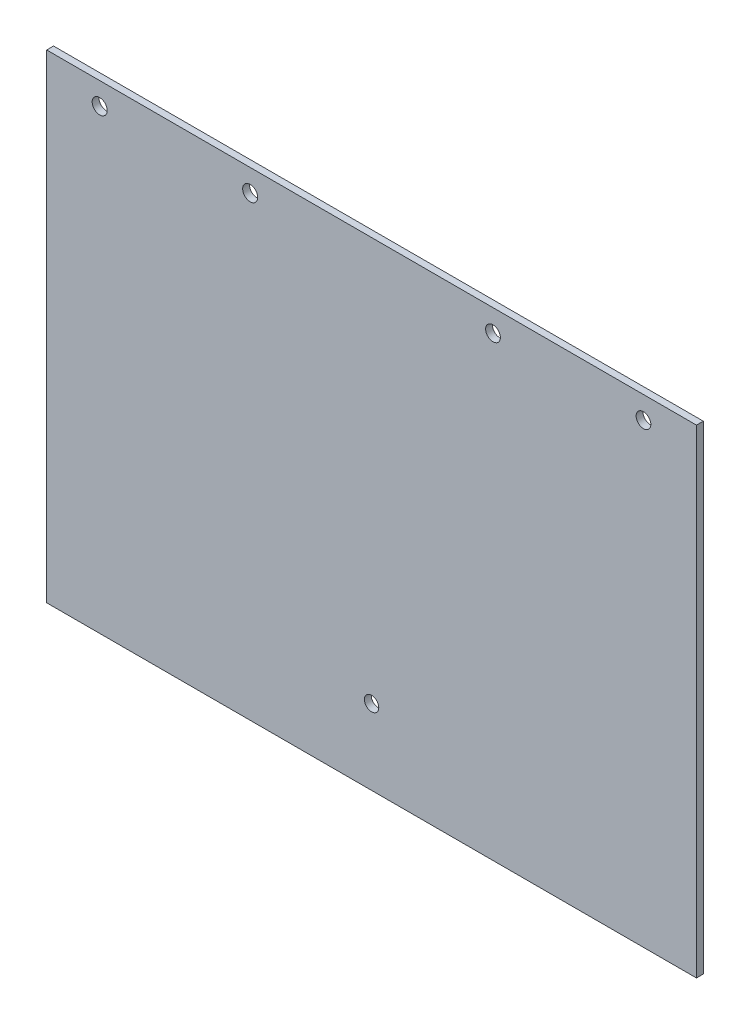
ISO-10303-21;
HEADER;
FILE_DESCRIPTION(('STEP AP214'),'2;1');
FILE_NAME('part.step','',(''),(''),'','','');
FILE_SCHEMA(('AUTOMOTIVE_DESIGN { 1 0 10303 214 1 1 1 1 }'));
ENDSEC;
DATA;
#1=APPLICATION_CONTEXT('core data for automotive mechanical design processes');
#2=APPLICATION_PROTOCOL_DEFINITION('international standard','automotive_design',2000,#1);
#3=PRODUCT_CONTEXT('',#1,'mechanical');
#4=PRODUCT('Part','Part','',(#3));
#5=PRODUCT_RELATED_PRODUCT_CATEGORY('part','',(#4));
#6=PRODUCT_DEFINITION_FORMATION('','',#4);
#7=PRODUCT_DEFINITION_CONTEXT('part definition',#1,'design');
#8=PRODUCT_DEFINITION('design','',#6,#7);
#9=PRODUCT_DEFINITION_SHAPE('','',#8);
#10=(LENGTH_UNIT() NAMED_UNIT(*) SI_UNIT(.MILLI.,.METRE.));
#11=(NAMED_UNIT(*) PLANE_ANGLE_UNIT() SI_UNIT($,.RADIAN.));
#12=(NAMED_UNIT(*) SI_UNIT($,.STERADIAN.) SOLID_ANGLE_UNIT());
#13=UNCERTAINTY_MEASURE_WITH_UNIT(LENGTH_MEASURE(1.E-05),#10,'distance_accuracy_value','');
#14=(GEOMETRIC_REPRESENTATION_CONTEXT(3) GLOBAL_UNCERTAINTY_ASSIGNED_CONTEXT((#13)) GLOBAL_UNIT_ASSIGNED_CONTEXT((#10,
#11,#12)) REPRESENTATION_CONTEXT('',''));
#15=CARTESIAN_POINT('',(0.,0.,0.));
#16=DIRECTION('',(0.,0.,1.));
#17=DIRECTION('',(1.,0.,0.));
#18=AXIS2_PLACEMENT_3D('',#15,#16,#17);
#19=CARTESIAN_POINT('',(-95.,-70.,2.));
#20=DIRECTION('',(0.,1.,0.));
#21=DIRECTION('',(0.,0.,1.));
#22=AXIS2_PLACEMENT_3D('',#19,#20,#21);
#23=PLANE('',#22);
#24=DIRECTION('',(1.,0.,0.));
#25=VECTOR('',#24,1.);
#26=CARTESIAN_POINT('',(-95.,-70.,0.));
#27=LINE('',#26,#25);
#28=CARTESIAN_POINT('',(-95.,-70.,0.));
#29=VERTEX_POINT('',#28);
#30=CARTESIAN_POINT('',(95.,-70.,0.));
#31=VERTEX_POINT('',#30);
#32=EDGE_CURVE('E110',#29,#31,#27,.T.);
#33=ORIENTED_EDGE('',*,*,#32,.T.);
#34=DIRECTION('',(0.,0.,-1.));
#35=VECTOR('',#34,1.);
#36=CARTESIAN_POINT('',(95.,-70.,2.));
#37=LINE('',#36,#35);
#38=CARTESIAN_POINT('',(95.,-70.,2.));
#39=VERTEX_POINT('',#38);
#40=EDGE_CURVE('E11',#39,#31,#37,.T.);
#41=ORIENTED_EDGE('',*,*,#40,.F.);
#42=DIRECTION('',(1.,0.,0.));
#43=VECTOR('',#42,1.);
#44=CARTESIAN_POINT('',(-95.,-70.,2.));
#45=LINE('',#44,#43);
#46=CARTESIAN_POINT('',(-95.,-70.,2.));
#47=VERTEX_POINT('',#46);
#48=EDGE_CURVE('E82',#47,#39,#45,.T.);
#49=ORIENTED_EDGE('',*,*,#48,.F.);
#50=DIRECTION('',(0.,0.,-1.));
#51=VECTOR('',#50,1.);
#52=CARTESIAN_POINT('',(-95.,-70.,2.));
#53=LINE('',#52,#51);
#54=EDGE_CURVE('E106',#47,#29,#53,.T.);
#55=ORIENTED_EDGE('',*,*,#54,.T.);
#56=EDGE_LOOP('',(#33,#41,#49,#55));
#57=FACE_BOUND('',#56,.T.);
#58=ADVANCED_FACE('F40',(#57),#23,.F.);
#59=CARTESIAN_POINT('',(95.,70.,2.));
#60=DIRECTION('',(1.,0.,0.));
#61=DIRECTION('',(0.,1.,0.));
#62=AXIS2_PLACEMENT_3D('',#59,#60,#61);
#63=PLANE('',#62);
#64=DIRECTION('',(0.,-1.,0.));
#65=VECTOR('',#64,1.);
#66=CARTESIAN_POINT('',(95.,70.,0.));
#67=LINE('',#66,#65);
#68=CARTESIAN_POINT('',(95.,70.,0.));
#69=VERTEX_POINT('',#68);
#70=EDGE_CURVE('E91',#69,#31,#67,.T.);
#71=ORIENTED_EDGE('',*,*,#70,.F.);
#72=DIRECTION('',(0.,0.,-1.));
#73=VECTOR('',#72,1.);
#74=CARTESIAN_POINT('',(95.,70.,2.));
#75=LINE('',#74,#73);
#76=CARTESIAN_POINT('',(95.,70.,2.));
#77=VERTEX_POINT('',#76);
#78=EDGE_CURVE('E50',#77,#69,#75,.T.);
#79=ORIENTED_EDGE('',*,*,#78,.F.);
#80=DIRECTION('',(0.,-1.,0.));
#81=VECTOR('',#80,1.);
#82=CARTESIAN_POINT('',(95.,70.,2.));
#83=LINE('',#82,#81);
#84=EDGE_CURVE('E89',#77,#39,#83,.T.);
#85=ORIENTED_EDGE('',*,*,#84,.T.);
#86=ORIENTED_EDGE('',*,*,#40,.T.);
#87=EDGE_LOOP('',(#71,#79,#85,#86));
#88=FACE_BOUND('',#87,.T.);
#89=ADVANCED_FACE('F88',(#88),#63,.T.);
#90=CARTESIAN_POINT('',(-95.,70.,2.));
#91=DIRECTION('',(0.,1.,0.));
#92=DIRECTION('',(0.,0.,1.));
#93=AXIS2_PLACEMENT_3D('',#90,#91,#92);
#94=PLANE('',#93);
#95=DIRECTION('',(1.,0.,0.));
#96=VECTOR('',#95,1.);
#97=CARTESIAN_POINT('',(-95.,70.,0.));
#98=LINE('',#97,#96);
#99=CARTESIAN_POINT('',(-95.,70.,0.));
#100=VERTEX_POINT('',#99);
#101=EDGE_CURVE('E117',#100,#69,#98,.T.);
#102=ORIENTED_EDGE('',*,*,#101,.F.);
#103=DIRECTION('',(0.,0.,-1.));
#104=VECTOR('',#103,1.);
#105=CARTESIAN_POINT('',(-95.,70.,2.));
#106=LINE('',#105,#104);
#107=CARTESIAN_POINT('',(-95.,70.,2.));
#108=VERTEX_POINT('',#107);
#109=EDGE_CURVE('E74',#108,#100,#106,.T.);
#110=ORIENTED_EDGE('',*,*,#109,.F.);
#111=DIRECTION('',(1.,0.,0.));
#112=VECTOR('',#111,1.);
#113=CARTESIAN_POINT('',(-95.,70.,2.));
#114=LINE('',#113,#112);
#115=EDGE_CURVE('E99',#108,#77,#114,.T.);
#116=ORIENTED_EDGE('',*,*,#115,.T.);
#117=ORIENTED_EDGE('',*,*,#78,.T.);
#118=EDGE_LOOP('',(#102,#110,#116,#117));
#119=FACE_BOUND('',#118,.T.);
#120=ADVANCED_FACE('F102',(#119),#94,.T.);
#121=CARTESIAN_POINT('',(-95.,70.,2.));
#122=DIRECTION('',(1.,0.,0.));
#123=DIRECTION('',(0.,1.,0.));
#124=AXIS2_PLACEMENT_3D('',#121,#122,#123);
#125=PLANE('',#124);
#126=DIRECTION('',(0.,-1.,0.));
#127=VECTOR('',#126,1.);
#128=CARTESIAN_POINT('',(-95.,70.,0.));
#129=LINE('',#128,#127);
#130=EDGE_CURVE('E77',#100,#29,#129,.T.);
#131=ORIENTED_EDGE('',*,*,#130,.T.);
#132=ORIENTED_EDGE('',*,*,#54,.F.);
#133=DIRECTION('',(0.,-1.,0.));
#134=VECTOR('',#133,1.);
#135=CARTESIAN_POINT('',(-95.,70.,2.));
#136=LINE('',#135,#134);
#137=EDGE_CURVE('E59',#108,#47,#136,.T.);
#138=ORIENTED_EDGE('',*,*,#137,.F.);
#139=ORIENTED_EDGE('',*,*,#109,.T.);
#140=EDGE_LOOP('',(#131,#132,#138,#139));
#141=FACE_BOUND('',#140,.T.);
#142=ADVANCED_FACE('F159',(#141),#125,.F.);
#143=CARTESIAN_POINT('',(0.,0.,2.));
#144=DIRECTION('',(0.,0.,-1.));
#145=DIRECTION('',(-1.,0.,0.));
#146=AXIS2_PLACEMENT_3D('',#143,#144,#145);
#147=PLANE('',#146);
#148=CARTESIAN_POINT('',(0.,-48.,2.));
#149=DIRECTION('',(0.,0.,1.));
#150=DIRECTION('',(1.,0.,0.));
#151=AXIS2_PLACEMENT_3D('',#148,#149,#150);
#152=CIRCLE('',#151,2.1);
#153=CARTESIAN_POINT('',(2.1,-48.,2.));
#154=VERTEX_POINT('',#153);
#155=EDGE_CURVE('E253',#154,#154,#152,.T.);
#156=ORIENTED_EDGE('',*,*,#155,.F.);
#157=EDGE_LOOP('',(#156));
#158=FACE_BOUND('',#157,.T.);
#159=CARTESIAN_POINT('',(-79.5,63.5,2.));
#160=DIRECTION('',(0.,0.,1.));
#161=DIRECTION('',(1.,0.,0.));
#162=AXIS2_PLACEMENT_3D('',#159,#160,#161);
#163=CIRCLE('',#162,2.2);
#164=CARTESIAN_POINT('',(-77.3,63.5,2.));
#165=VERTEX_POINT('',#164);
#166=EDGE_CURVE('E131',#165,#165,#163,.T.);
#167=ORIENTED_EDGE('',*,*,#166,.F.);
#168=EDGE_LOOP('',(#167));
#169=FACE_BOUND('',#168,.T.);
#170=CARTESIAN_POINT('',(35.5,63.5,2.));
#171=DIRECTION('',(0.,0.,1.));
#172=DIRECTION('',(1.,0.,0.));
#173=AXIS2_PLACEMENT_3D('',#170,#171,#172);
#174=CIRCLE('',#173,2.15);
#175=CARTESIAN_POINT('',(37.65,63.5,2.));
#176=VERTEX_POINT('',#175);
#177=EDGE_CURVE('E257',#176,#176,#174,.T.);
#178=ORIENTED_EDGE('',*,*,#177,.F.);
#179=EDGE_LOOP('',(#178));
#180=FACE_BOUND('',#179,.T.);
#181=CARTESIAN_POINT('',(79.5,63.5,2.));
#182=DIRECTION('',(0.,0.,1.));
#183=DIRECTION('',(1.,0.,0.));
#184=AXIS2_PLACEMENT_3D('',#181,#182,#183);
#185=CIRCLE('',#184,2.15);
#186=CARTESIAN_POINT('',(81.65,63.5,2.));
#187=VERTEX_POINT('',#186);
#188=EDGE_CURVE('E266',#187,#187,#185,.T.);
#189=ORIENTED_EDGE('',*,*,#188,.F.);
#190=EDGE_LOOP('',(#189));
#191=FACE_BOUND('',#190,.T.);
#192=CARTESIAN_POINT('',(-35.5,63.5,2.));
#193=DIRECTION('',(0.,0.,1.));
#194=DIRECTION('',(1.,0.,0.));
#195=AXIS2_PLACEMENT_3D('',#192,#193,#194);
#196=CIRCLE('',#195,2.2);
#197=CARTESIAN_POINT('',(-33.3,63.5,2.));
#198=VERTEX_POINT('',#197);
#199=EDGE_CURVE('E262',#198,#198,#196,.T.);
#200=ORIENTED_EDGE('',*,*,#199,.F.);
#201=EDGE_LOOP('',(#200));
#202=FACE_BOUND('',#201,.T.);
#203=ORIENTED_EDGE('',*,*,#48,.T.);
#204=ORIENTED_EDGE('',*,*,#84,.F.);
#205=ORIENTED_EDGE('',*,*,#115,.F.);
#206=ORIENTED_EDGE('',*,*,#137,.T.);
#207=EDGE_LOOP('',(#203,#204,#205,#206));
#208=FACE_BOUND('',#207,.T.);
#209=ADVANCED_FACE('F98',(#158,#169,#180,#191,#202,#208),#147,.F.);
#210=CARTESIAN_POINT('',(0.,0.,0.));
#211=DIRECTION('',(0.,0.,-1.));
#212=DIRECTION('',(-1.,0.,0.));
#213=AXIS2_PLACEMENT_3D('',#210,#211,#212);
#214=PLANE('',#213);
#215=CARTESIAN_POINT('',(0.,-48.,0.));
#216=DIRECTION('',(0.,0.,-1.));
#217=DIRECTION('',(-1.,0.,0.));
#218=AXIS2_PLACEMENT_3D('',#215,#216,#217);
#219=CIRCLE('',#218,2.1);
#220=CARTESIAN_POINT('',(-2.1,-48.,0.));
#221=VERTEX_POINT('',#220);
#222=EDGE_CURVE('E43',#221,#221,#219,.T.);
#223=ORIENTED_EDGE('',*,*,#222,.F.);
#224=EDGE_LOOP('',(#223));
#225=FACE_BOUND('',#224,.T.);
#226=CARTESIAN_POINT('',(-79.5,63.5,0.));
#227=DIRECTION('',(0.,0.,-1.));
#228=DIRECTION('',(-1.,0.,0.));
#229=AXIS2_PLACEMENT_3D('',#226,#227,#228);
#230=CIRCLE('',#229,2.2);
#231=CARTESIAN_POINT('',(-81.7,63.5,0.));
#232=VERTEX_POINT('',#231);
#233=EDGE_CURVE('E114',#232,#232,#230,.T.);
#234=ORIENTED_EDGE('',*,*,#233,.F.);
#235=EDGE_LOOP('',(#234));
#236=FACE_BOUND('',#235,.T.);
#237=CARTESIAN_POINT('',(35.5,63.5,0.));
#238=DIRECTION('',(0.,0.,-1.));
#239=DIRECTION('',(-1.,0.,0.));
#240=AXIS2_PLACEMENT_3D('',#237,#238,#239);
#241=CIRCLE('',#240,2.15);
#242=CARTESIAN_POINT('',(33.35,63.5,0.));
#243=VERTEX_POINT('',#242);
#244=EDGE_CURVE('E135',#243,#243,#241,.T.);
#245=ORIENTED_EDGE('',*,*,#244,.F.);
#246=EDGE_LOOP('',(#245));
#247=FACE_BOUND('',#246,.T.);
#248=CARTESIAN_POINT('',(79.5,63.5,0.));
#249=DIRECTION('',(0.,0.,-1.));
#250=DIRECTION('',(-1.,0.,0.));
#251=AXIS2_PLACEMENT_3D('',#248,#249,#250);
#252=CIRCLE('',#251,2.15);
#253=CARTESIAN_POINT('',(77.35,63.5,0.));
#254=VERTEX_POINT('',#253);
#255=EDGE_CURVE('E130',#254,#254,#252,.T.);
#256=ORIENTED_EDGE('',*,*,#255,.F.);
#257=EDGE_LOOP('',(#256));
#258=FACE_BOUND('',#257,.T.);
#259=CARTESIAN_POINT('',(-35.5,63.5,0.));
#260=DIRECTION('',(0.,0.,-1.));
#261=DIRECTION('',(-1.,0.,0.));
#262=AXIS2_PLACEMENT_3D('',#259,#260,#261);
#263=CIRCLE('',#262,2.2);
#264=CARTESIAN_POINT('',(-37.7,63.5,0.));
#265=VERTEX_POINT('',#264);
#266=EDGE_CURVE('E126',#265,#265,#263,.T.);
#267=ORIENTED_EDGE('',*,*,#266,.F.);
#268=EDGE_LOOP('',(#267));
#269=FACE_BOUND('',#268,.T.);
#270=ORIENTED_EDGE('',*,*,#32,.F.);
#271=ORIENTED_EDGE('',*,*,#130,.F.);
#272=ORIENTED_EDGE('',*,*,#101,.T.);
#273=ORIENTED_EDGE('',*,*,#70,.T.);
#274=EDGE_LOOP('',(#270,#271,#272,#273));
#275=FACE_BOUND('',#274,.T.);
#276=ADVANCED_FACE('F145',(#225,#236,#247,#258,#269,#275),#214,.T.);
#277=CARTESIAN_POINT('',(-35.5,63.5,-8.));
#278=DIRECTION('',(0.,0.,1.));
#279=DIRECTION('',(1.,0.,0.));
#280=AXIS2_PLACEMENT_3D('',#277,#278,#279);
#281=CYLINDRICAL_SURFACE('',#280,2.2);
#282=ORIENTED_EDGE('',*,*,#266,.T.);
#283=EDGE_LOOP('',(#282));
#284=FACE_BOUND('',#283,.T.);
#285=ORIENTED_EDGE('',*,*,#199,.T.);
#286=EDGE_LOOP('',(#285));
#287=FACE_BOUND('',#286,.T.);
#288=ADVANCED_FACE('F148',(#284,#287),#281,.F.);
#289=CARTESIAN_POINT('',(79.5,63.5,-8.));
#290=DIRECTION('',(0.,0.,1.));
#291=DIRECTION('',(1.,0.,0.));
#292=AXIS2_PLACEMENT_3D('',#289,#290,#291);
#293=CYLINDRICAL_SURFACE('',#292,2.15);
#294=ORIENTED_EDGE('',*,*,#255,.T.);
#295=EDGE_LOOP('',(#294));
#296=FACE_BOUND('',#295,.T.);
#297=ORIENTED_EDGE('',*,*,#188,.T.);
#298=EDGE_LOOP('',(#297));
#299=FACE_BOUND('',#298,.T.);
#300=ADVANCED_FACE('F193',(#296,#299),#293,.F.);
#301=CARTESIAN_POINT('',(35.5,63.5,-8.));
#302=DIRECTION('',(0.,0.,1.));
#303=DIRECTION('',(1.,0.,0.));
#304=AXIS2_PLACEMENT_3D('',#301,#302,#303);
#305=CYLINDRICAL_SURFACE('',#304,2.15);
#306=ORIENTED_EDGE('',*,*,#244,.T.);
#307=EDGE_LOOP('',(#306));
#308=FACE_BOUND('',#307,.T.);
#309=ORIENTED_EDGE('',*,*,#177,.T.);
#310=EDGE_LOOP('',(#309));
#311=FACE_BOUND('',#310,.T.);
#312=ADVANCED_FACE('F204',(#308,#311),#305,.F.);
#313=CARTESIAN_POINT('',(-79.5,63.5,-8.));
#314=DIRECTION('',(0.,0.,1.));
#315=DIRECTION('',(1.,0.,0.));
#316=AXIS2_PLACEMENT_3D('',#313,#314,#315);
#317=CYLINDRICAL_SURFACE('',#316,2.2);
#318=ORIENTED_EDGE('',*,*,#233,.T.);
#319=EDGE_LOOP('',(#318));
#320=FACE_BOUND('',#319,.T.);
#321=ORIENTED_EDGE('',*,*,#166,.T.);
#322=EDGE_LOOP('',(#321));
#323=FACE_BOUND('',#322,.T.);
#324=ADVANCED_FACE('F142',(#320,#323),#317,.F.);
#325=CARTESIAN_POINT('',(0.,-48.,-8.));
#326=DIRECTION('',(0.,0.,1.));
#327=DIRECTION('',(1.,0.,0.));
#328=AXIS2_PLACEMENT_3D('',#325,#326,#327);
#329=CYLINDRICAL_SURFACE('',#328,2.1);
#330=ORIENTED_EDGE('',*,*,#222,.T.);
#331=EDGE_LOOP('',(#330));
#332=FACE_BOUND('',#331,.T.);
#333=ORIENTED_EDGE('',*,*,#155,.T.);
#334=EDGE_LOOP('',(#333));
#335=FACE_BOUND('',#334,.T.);
#336=ADVANCED_FACE('F223',(#332,#335),#329,.F.);
#337=CLOSED_SHELL('',(#58,#89,#120,#142,#209,#276,#288,#300,#312,#324,#336));
#338=MANIFOLD_SOLID_BREP('B2',#337);
#339=ADVANCED_BREP_SHAPE_REPRESENTATION('',(#18,#338),#14);
#340=SHAPE_DEFINITION_REPRESENTATION(#9,#339);
ENDSEC;
END-ISO-10303-21;
